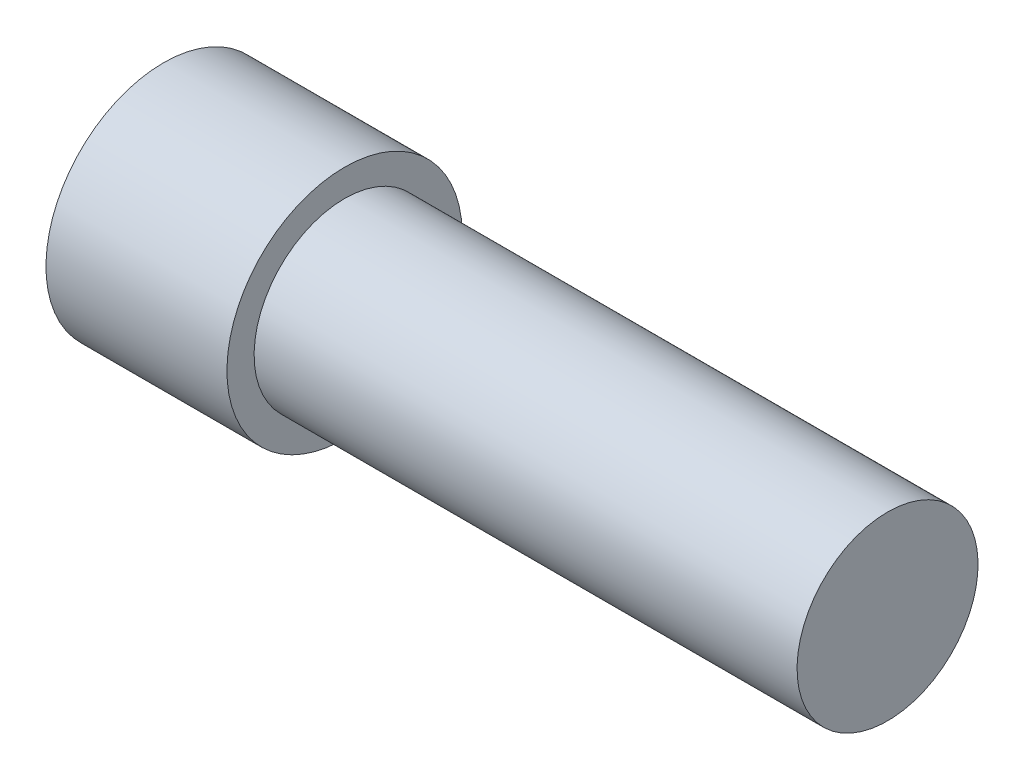
ISO-10303-21;
HEADER;
FILE_DESCRIPTION(('STEP AP214'),'2;1');
FILE_NAME('part.step','',(''),(''),'','','');
FILE_SCHEMA(('AUTOMOTIVE_DESIGN { 1 0 10303 214 1 1 1 1 }'));
ENDSEC;
DATA;
#1=APPLICATION_CONTEXT('core data for automotive mechanical design processes');
#2=APPLICATION_PROTOCOL_DEFINITION('international standard','automotive_design',2000,#1);
#3=PRODUCT_CONTEXT('',#1,'mechanical');
#4=PRODUCT('Part','Part','',(#3));
#5=PRODUCT_RELATED_PRODUCT_CATEGORY('part','',(#4));
#6=PRODUCT_DEFINITION_FORMATION('','',#4);
#7=PRODUCT_DEFINITION_CONTEXT('part definition',#1,'design');
#8=PRODUCT_DEFINITION('design','',#6,#7);
#9=PRODUCT_DEFINITION_SHAPE('','',#8);
#10=(LENGTH_UNIT() NAMED_UNIT(*) SI_UNIT(.MILLI.,.METRE.));
#11=(NAMED_UNIT(*) PLANE_ANGLE_UNIT() SI_UNIT($,.RADIAN.));
#12=(NAMED_UNIT(*) SI_UNIT($,.STERADIAN.) SOLID_ANGLE_UNIT());
#13=UNCERTAINTY_MEASURE_WITH_UNIT(LENGTH_MEASURE(1.E-05),#10,'distance_accuracy_value','');
#14=(GEOMETRIC_REPRESENTATION_CONTEXT(3) GLOBAL_UNCERTAINTY_ASSIGNED_CONTEXT((#13)) GLOBAL_UNIT_ASSIGNED_CONTEXT((#10,
#11,#12)) REPRESENTATION_CONTEXT('',''));
#15=CARTESIAN_POINT('',(0.,0.,0.));
#16=DIRECTION('',(0.,0.,1.));
#17=DIRECTION('',(1.,0.,0.));
#18=AXIS2_PLACEMENT_3D('',#15,#16,#17);
#19=CARTESIAN_POINT('',(-20.,0.,0.));
#20=DIRECTION('',(-1.,0.,0.));
#21=DIRECTION('',(0.,-1.,0.));
#22=AXIS2_PLACEMENT_3D('',#19,#20,#21);
#23=PLANE('',#22);
#24=DIRECTION('',(0.,0.866025403784439,0.5));
#25=VECTOR('',#24,1.);
#26=CARTESIAN_POINT('',(-20.,-4.5,2.59807621135332));
#27=LINE('',#26,#25);
#28=CARTESIAN_POINT('',(-20.,-4.5,2.59807621135332));
#29=VERTEX_POINT('',#28);
#30=CARTESIAN_POINT('',(-20.,0.,5.19615242270663));
#31=VERTEX_POINT('',#30);
#32=EDGE_CURVE('E58',#29,#31,#27,.T.);
#33=ORIENTED_EDGE('',*,*,#32,.F.);
#34=DIRECTION('',(0.,0.,1.));
#35=VECTOR('',#34,1.);
#36=CARTESIAN_POINT('',(-20.,-4.5,-2.59807621135332));
#37=LINE('',#36,#35);
#38=CARTESIAN_POINT('',(-20.,-4.5,-2.59807621135332));
#39=VERTEX_POINT('',#38);
#40=EDGE_CURVE('E151',#39,#29,#37,.T.);
#41=ORIENTED_EDGE('',*,*,#40,.F.);
#42=DIRECTION('',(0.,-0.866025403784438,0.5));
#43=VECTOR('',#42,1.);
#44=CARTESIAN_POINT('',(-20.,0.,-5.19615242270663));
#45=LINE('',#44,#43);
#46=CARTESIAN_POINT('',(-20.,0.,-5.19615242270663));
#47=VERTEX_POINT('',#46);
#48=EDGE_CURVE('E148',#47,#39,#45,.T.);
#49=ORIENTED_EDGE('',*,*,#48,.F.);
#50=DIRECTION('',(0.,-0.866025403784439,-0.5));
#51=VECTOR('',#50,1.);
#52=CARTESIAN_POINT('',(-20.,4.5,-2.59807621135331));
#53=LINE('',#52,#51);
#54=CARTESIAN_POINT('',(-20.,4.5,-2.59807621135331));
#55=VERTEX_POINT('',#54);
#56=EDGE_CURVE('E106',#55,#47,#53,.T.);
#57=ORIENTED_EDGE('',*,*,#56,.F.);
#58=DIRECTION('',(0.,0.,-1.));
#59=VECTOR('',#58,1.);
#60=CARTESIAN_POINT('',(-20.,4.5,2.59807621135332));
#61=LINE('',#60,#59);
#62=CARTESIAN_POINT('',(-20.,4.5,2.59807621135332));
#63=VERTEX_POINT('',#62);
#64=EDGE_CURVE('E142',#63,#55,#61,.T.);
#65=ORIENTED_EDGE('',*,*,#64,.F.);
#66=DIRECTION('',(0.,0.866025403784438,-0.5));
#67=VECTOR('',#66,1.);
#68=CARTESIAN_POINT('',(-20.,0.,5.19615242270663));
#69=LINE('',#68,#67);
#70=EDGE_CURVE('E138',#31,#63,#69,.T.);
#71=ORIENTED_EDGE('',*,*,#70,.F.);
#72=EDGE_LOOP('',(#33,#41,#49,#57,#65,#71));
#73=FACE_BOUND('',#72,.T.);
#74=CARTESIAN_POINT('',(-20.,0.,0.));
#75=DIRECTION('',(1.,0.,0.));
#76=DIRECTION('',(0.,1.,0.));
#77=AXIS2_PLACEMENT_3D('',#74,#75,#76);
#78=CIRCLE('',#77,6.5);
#79=CARTESIAN_POINT('',(-20.,6.5,0.));
#80=VERTEX_POINT('',#79);
#81=EDGE_CURVE('E11',#80,#80,#78,.T.);
#82=ORIENTED_EDGE('',*,*,#81,.F.);
#83=EDGE_LOOP('',(#82));
#84=FACE_BOUND('',#83,.T.);
#85=ADVANCED_FACE('F43',(#73,#84),#23,.T.);
#86=CARTESIAN_POINT('',(20.,0.,0.));
#87=DIRECTION('',(1.,0.,0.));
#88=DIRECTION('',(0.,1.,0.));
#89=AXIS2_PLACEMENT_3D('',#86,#87,#88);
#90=CYLINDRICAL_SURFACE('',#89,6.5);
#91=ORIENTED_EDGE('',*,*,#81,.T.);
#92=EDGE_LOOP('',(#91));
#93=FACE_BOUND('',#92,.T.);
#94=CARTESIAN_POINT('',(-10.,0.,0.));
#95=DIRECTION('',(1.,0.,0.));
#96=DIRECTION('',(0.,1.,0.));
#97=AXIS2_PLACEMENT_3D('',#94,#95,#96);
#98=CIRCLE('',#97,6.5);
#99=CARTESIAN_POINT('',(-10.,6.5,0.));
#100=VERTEX_POINT('',#99);
#101=EDGE_CURVE('E51',#100,#100,#98,.T.);
#102=ORIENTED_EDGE('',*,*,#101,.F.);
#103=EDGE_LOOP('',(#102));
#104=FACE_BOUND('',#103,.T.);
#105=ADVANCED_FACE('F180',(#93,#104),#90,.T.);
#106=CARTESIAN_POINT('',(-10.,6.5,0.));
#107=DIRECTION('',(1.,0.,0.));
#108=DIRECTION('',(0.,1.,0.));
#109=AXIS2_PLACEMENT_3D('',#106,#107,#108);
#110=PLANE('',#109);
#111=ORIENTED_EDGE('',*,*,#101,.T.);
#112=EDGE_LOOP('',(#111));
#113=FACE_BOUND('',#112,.T.);
#114=CARTESIAN_POINT('',(-10.,0.,0.));
#115=DIRECTION('',(1.,0.,0.));
#116=DIRECTION('',(0.,1.,0.));
#117=AXIS2_PLACEMENT_3D('',#114,#115,#116);
#118=CIRCLE('',#117,5.);
#119=CARTESIAN_POINT('',(-10.,5.,0.));
#120=VERTEX_POINT('',#119);
#121=EDGE_CURVE('E170',#120,#120,#118,.T.);
#122=ORIENTED_EDGE('',*,*,#121,.F.);
#123=EDGE_LOOP('',(#122));
#124=FACE_BOUND('',#123,.T.);
#125=ADVANCED_FACE('F177',(#113,#124),#110,.T.);
#126=CARTESIAN_POINT('',(20.,0.,0.));
#127=DIRECTION('',(1.,0.,0.));
#128=DIRECTION('',(0.,1.,0.));
#129=AXIS2_PLACEMENT_3D('',#126,#127,#128);
#130=CYLINDRICAL_SURFACE('',#129,5.);
#131=ORIENTED_EDGE('',*,*,#121,.T.);
#132=EDGE_LOOP('',(#131));
#133=FACE_BOUND('',#132,.T.);
#134=CARTESIAN_POINT('',(20.,0.,0.));
#135=DIRECTION('',(1.,0.,0.));
#136=DIRECTION('',(0.,1.,0.));
#137=AXIS2_PLACEMENT_3D('',#134,#135,#136);
#138=CIRCLE('',#137,5.);
#139=CARTESIAN_POINT('',(20.,5.,0.));
#140=VERTEX_POINT('',#139);
#141=EDGE_CURVE('E157',#140,#140,#138,.T.);
#142=ORIENTED_EDGE('',*,*,#141,.F.);
#143=EDGE_LOOP('',(#142));
#144=FACE_BOUND('',#143,.T.);
#145=ADVANCED_FACE('F187',(#133,#144),#130,.T.);
#146=CARTESIAN_POINT('',(20.,5.,0.));
#147=DIRECTION('',(1.,0.,0.));
#148=DIRECTION('',(0.,1.,0.));
#149=AXIS2_PLACEMENT_3D('',#146,#147,#148);
#150=PLANE('',#149);
#151=ORIENTED_EDGE('',*,*,#141,.T.);
#152=EDGE_LOOP('',(#151));
#153=FACE_BOUND('',#152,.T.);
#154=ADVANCED_FACE('F193',(#153),#150,.T.);
#155=CARTESIAN_POINT('',(-11.,-4.5,2.59807621135332));
#156=DIRECTION('',(0.,-0.5,0.866025403784439));
#157=DIRECTION('',(0.,-0.866025403784439,-0.5));
#158=AXIS2_PLACEMENT_3D('',#155,#156,#157);
#159=PLANE('',#158);
#160=ORIENTED_EDGE('',*,*,#32,.T.);
#161=DIRECTION('',(-1.,0.,0.));
#162=VECTOR('',#161,1.);
#163=CARTESIAN_POINT('',(-11.,0.,5.19615242270663));
#164=LINE('',#163,#162);
#165=CARTESIAN_POINT('',(-11.,0.,5.19615242270663));
#166=VERTEX_POINT('',#165);
#167=EDGE_CURVE('E88',#166,#31,#164,.T.);
#168=ORIENTED_EDGE('',*,*,#167,.F.);
#169=DIRECTION('',(0.,0.866025403784439,0.5));
#170=VECTOR('',#169,1.);
#171=CARTESIAN_POINT('',(-11.,-4.5,2.59807621135332));
#172=LINE('',#171,#170);
#173=CARTESIAN_POINT('',(-11.,-4.5,2.59807621135332));
#174=VERTEX_POINT('',#173);
#175=EDGE_CURVE('E154',#174,#166,#172,.T.);
#176=ORIENTED_EDGE('',*,*,#175,.F.);
#177=DIRECTION('',(-1.,0.,0.));
#178=VECTOR('',#177,1.);
#179=CARTESIAN_POINT('',(-11.,-4.5,2.59807621135332));
#180=LINE('',#179,#178);
#181=EDGE_CURVE('E66',#174,#29,#180,.T.);
#182=ORIENTED_EDGE('',*,*,#181,.T.);
#183=EDGE_LOOP('',(#160,#168,#176,#182));
#184=FACE_BOUND('',#183,.T.);
#185=ADVANCED_FACE('F197',(#184),#159,.F.);
#186=CARTESIAN_POINT('',(-11.,-4.5,-2.59807621135332));
#187=DIRECTION('',(0.,-1.,0.));
#188=DIRECTION('',(0.,0.,-1.));
#189=AXIS2_PLACEMENT_3D('',#186,#187,#188);
#190=PLANE('',#189);
#191=ORIENTED_EDGE('',*,*,#40,.T.);
#192=ORIENTED_EDGE('',*,*,#181,.F.);
#193=DIRECTION('',(0.,0.,1.));
#194=VECTOR('',#193,1.);
#195=CARTESIAN_POINT('',(-11.,-4.5,-2.59807621135332));
#196=LINE('',#195,#194);
#197=CARTESIAN_POINT('',(-11.,-4.5,-2.59807621135332));
#198=VERTEX_POINT('',#197);
#199=EDGE_CURVE('E120',#198,#174,#196,.T.);
#200=ORIENTED_EDGE('',*,*,#199,.F.);
#201=DIRECTION('',(-1.,0.,0.));
#202=VECTOR('',#201,1.);
#203=CARTESIAN_POINT('',(-11.,-4.5,-2.59807621135332));
#204=LINE('',#203,#202);
#205=EDGE_CURVE('E111',#198,#39,#204,.T.);
#206=ORIENTED_EDGE('',*,*,#205,.T.);
#207=EDGE_LOOP('',(#191,#192,#200,#206));
#208=FACE_BOUND('',#207,.T.);
#209=ADVANCED_FACE('F201',(#208),#190,.F.);
#210=CARTESIAN_POINT('',(-11.,0.,-5.19615242270663));
#211=DIRECTION('',(0.,-0.5,-0.866025403784439));
#212=DIRECTION('',(0.,0.866025403784439,-0.5));
#213=AXIS2_PLACEMENT_3D('',#210,#211,#212);
#214=PLANE('',#213);
#215=ORIENTED_EDGE('',*,*,#48,.T.);
#216=ORIENTED_EDGE('',*,*,#205,.F.);
#217=DIRECTION('',(0.,-0.866025403784438,0.5));
#218=VECTOR('',#217,1.);
#219=CARTESIAN_POINT('',(-11.,0.,-5.19615242270663));
#220=LINE('',#219,#218);
#221=CARTESIAN_POINT('',(-11.,0.,-5.19615242270663));
#222=VERTEX_POINT('',#221);
#223=EDGE_CURVE('E115',#222,#198,#220,.T.);
#224=ORIENTED_EDGE('',*,*,#223,.F.);
#225=DIRECTION('',(-1.,0.,0.));
#226=VECTOR('',#225,1.);
#227=CARTESIAN_POINT('',(-11.,0.,-5.19615242270663));
#228=LINE('',#227,#226);
#229=EDGE_CURVE('E99',#222,#47,#228,.T.);
#230=ORIENTED_EDGE('',*,*,#229,.T.);
#231=EDGE_LOOP('',(#215,#216,#224,#230));
#232=FACE_BOUND('',#231,.T.);
#233=ADVANCED_FACE('F116',(#232),#214,.F.);
#234=CARTESIAN_POINT('',(-11.,4.5,-2.59807621135331));
#235=DIRECTION('',(0.,0.5,-0.866025403784439));
#236=DIRECTION('',(0.,0.866025403784439,0.5));
#237=AXIS2_PLACEMENT_3D('',#234,#235,#236);
#238=PLANE('',#237);
#239=ORIENTED_EDGE('',*,*,#56,.T.);
#240=ORIENTED_EDGE('',*,*,#229,.F.);
#241=DIRECTION('',(0.,-0.866025403784439,-0.5));
#242=VECTOR('',#241,1.);
#243=CARTESIAN_POINT('',(-11.,4.5,-2.59807621135331));
#244=LINE('',#243,#242);
#245=CARTESIAN_POINT('',(-11.,4.5,-2.59807621135331));
#246=VERTEX_POINT('',#245);
#247=EDGE_CURVE('E103',#246,#222,#244,.T.);
#248=ORIENTED_EDGE('',*,*,#247,.F.);
#249=DIRECTION('',(-1.,0.,0.));
#250=VECTOR('',#249,1.);
#251=CARTESIAN_POINT('',(-11.,4.5,-2.59807621135331));
#252=LINE('',#251,#250);
#253=EDGE_CURVE('E112',#246,#55,#252,.T.);
#254=ORIENTED_EDGE('',*,*,#253,.T.);
#255=EDGE_LOOP('',(#239,#240,#248,#254));
#256=FACE_BOUND('',#255,.T.);
#257=ADVANCED_FACE('F101',(#256),#238,.F.);
#258=CARTESIAN_POINT('',(-11.,4.5,2.59807621135332));
#259=DIRECTION('',(0.,1.,0.));
#260=DIRECTION('',(-1.,0.,0.));
#261=AXIS2_PLACEMENT_3D('',#258,#259,#260);
#262=PLANE('',#261);
#263=ORIENTED_EDGE('',*,*,#64,.T.);
#264=ORIENTED_EDGE('',*,*,#253,.F.);
#265=DIRECTION('',(0.,0.,-1.));
#266=VECTOR('',#265,1.);
#267=CARTESIAN_POINT('',(-11.,4.5,2.59807621135332));
#268=LINE('',#267,#266);
#269=CARTESIAN_POINT('',(-11.,4.5,2.59807621135332));
#270=VERTEX_POINT('',#269);
#271=EDGE_CURVE('E126',#270,#246,#268,.T.);
#272=ORIENTED_EDGE('',*,*,#271,.F.);
#273=DIRECTION('',(-1.,0.,0.));
#274=VECTOR('',#273,1.);
#275=CARTESIAN_POINT('',(-11.,4.5,2.59807621135332));
#276=LINE('',#275,#274);
#277=EDGE_CURVE('E162',#270,#63,#276,.T.);
#278=ORIENTED_EDGE('',*,*,#277,.T.);
#279=EDGE_LOOP('',(#263,#264,#272,#278));
#280=FACE_BOUND('',#279,.T.);
#281=ADVANCED_FACE('F205',(#280),#262,.F.);
#282=CARTESIAN_POINT('',(-11.,0.,5.19615242270663));
#283=DIRECTION('',(0.,0.5,0.866025403784438));
#284=DIRECTION('',(0.,-0.866025403784438,0.500000000000001));
#285=AXIS2_PLACEMENT_3D('',#282,#283,#284);
#286=PLANE('',#285);
#287=ORIENTED_EDGE('',*,*,#70,.T.);
#288=ORIENTED_EDGE('',*,*,#277,.F.);
#289=DIRECTION('',(0.,0.866025403784438,-0.5));
#290=VECTOR('',#289,1.);
#291=CARTESIAN_POINT('',(-11.,0.,5.19615242270663));
#292=LINE('',#291,#290);
#293=EDGE_CURVE('E130',#166,#270,#292,.T.);
#294=ORIENTED_EDGE('',*,*,#293,.F.);
#295=ORIENTED_EDGE('',*,*,#167,.T.);
#296=EDGE_LOOP('',(#287,#288,#294,#295));
#297=FACE_BOUND('',#296,.T.);
#298=ADVANCED_FACE('F202',(#297),#286,.F.);
#299=CARTESIAN_POINT('',(-11.,0.,0.));
#300=DIRECTION('',(-1.,0.,0.));
#301=DIRECTION('',(0.,0.,1.));
#302=AXIS2_PLACEMENT_3D('',#299,#300,#301);
#303=PLANE('',#302);
#304=ORIENTED_EDGE('',*,*,#175,.T.);
#305=ORIENTED_EDGE('',*,*,#293,.T.);
#306=ORIENTED_EDGE('',*,*,#271,.T.);
#307=ORIENTED_EDGE('',*,*,#247,.T.);
#308=ORIENTED_EDGE('',*,*,#223,.T.);
#309=ORIENTED_EDGE('',*,*,#199,.T.);
#310=EDGE_LOOP('',(#304,#305,#306,#307,#308,#309));
#311=FACE_BOUND('',#310,.T.);
#312=ADVANCED_FACE('F123',(#311),#303,.T.);
#313=CLOSED_SHELL('',(#85,#105,#125,#145,#154,#185,#209,#233,#257,#281,#298,#312));
#314=MANIFOLD_SOLID_BREP('B2',#313);
#315=ADVANCED_BREP_SHAPE_REPRESENTATION('',(#18,#314),#14);
#316=SHAPE_DEFINITION_REPRESENTATION(#9,#315);
ENDSEC;
END-ISO-10303-21;
